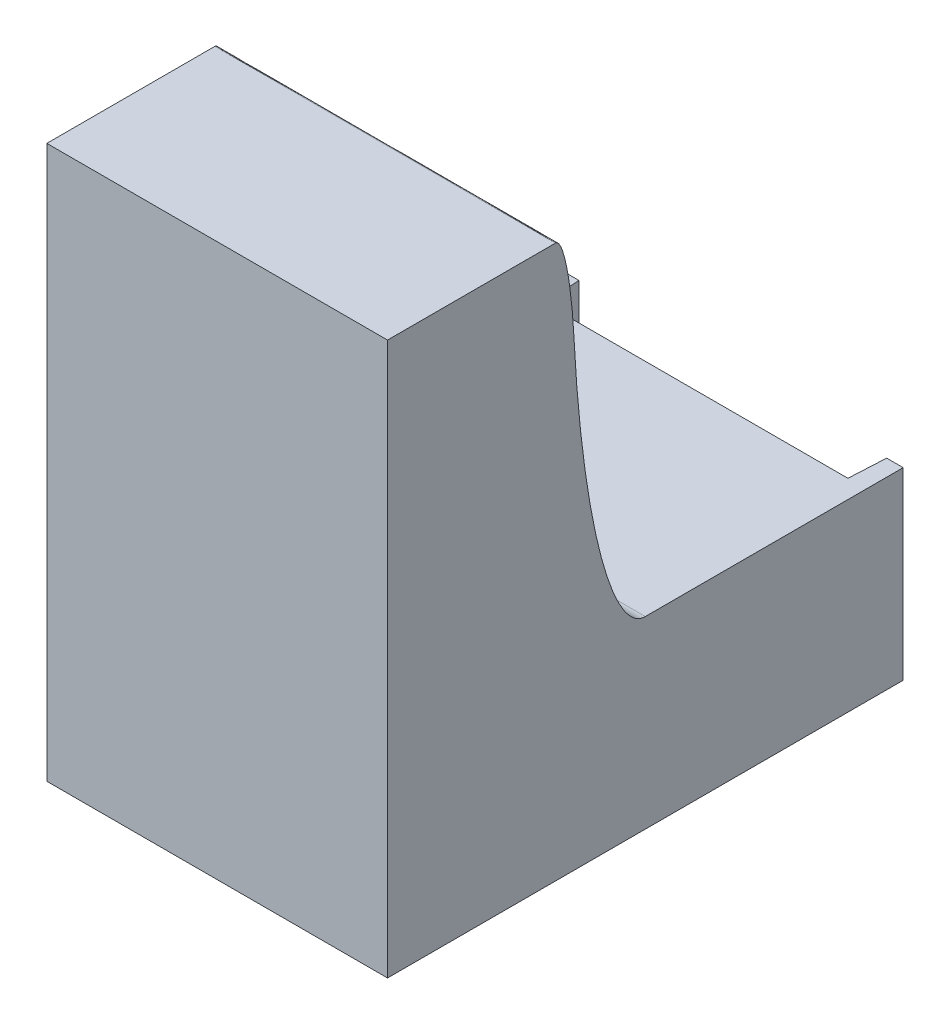
ISO-10303-21;
HEADER;
FILE_DESCRIPTION(('STEP AP214'),'2;1');
FILE_NAME('part.step','',(''),(''),'','','');
FILE_SCHEMA(('AUTOMOTIVE_DESIGN { 1 0 10303 214 1 1 1 1 }'));
ENDSEC;
DATA;
#1=APPLICATION_CONTEXT('core data for automotive mechanical design processes');
#2=APPLICATION_PROTOCOL_DEFINITION('international standard','automotive_design',2000,#1);
#3=PRODUCT_CONTEXT('',#1,'mechanical');
#4=PRODUCT('Part','Part','',(#3));
#5=PRODUCT_RELATED_PRODUCT_CATEGORY('part','',(#4));
#6=PRODUCT_DEFINITION_FORMATION('','',#4);
#7=PRODUCT_DEFINITION_CONTEXT('part definition',#1,'design');
#8=PRODUCT_DEFINITION('design','',#6,#7);
#9=PRODUCT_DEFINITION_SHAPE('','',#8);
#10=(LENGTH_UNIT() NAMED_UNIT(*) SI_UNIT(.MILLI.,.METRE.));
#11=(NAMED_UNIT(*) PLANE_ANGLE_UNIT() SI_UNIT($,.RADIAN.));
#12=(NAMED_UNIT(*) SI_UNIT($,.STERADIAN.) SOLID_ANGLE_UNIT());
#13=UNCERTAINTY_MEASURE_WITH_UNIT(LENGTH_MEASURE(1.E-05),#10,'distance_accuracy_value','');
#14=(GEOMETRIC_REPRESENTATION_CONTEXT(3) GLOBAL_UNCERTAINTY_ASSIGNED_CONTEXT((#13)) GLOBAL_UNIT_ASSIGNED_CONTEXT((#10,
#11,#12)) REPRESENTATION_CONTEXT('',''));
#15=CARTESIAN_POINT('',(0.,0.,0.));
#16=DIRECTION('',(0.,0.,1.));
#17=DIRECTION('',(1.,0.,0.));
#18=AXIS2_PLACEMENT_3D('',#15,#16,#17);
#19=CARTESIAN_POINT('',(0.,0.,26.));
#20=DIRECTION('',(0.,0.,1.));
#21=DIRECTION('',(1.,0.,0.));
#22=AXIS2_PLACEMENT_3D('',#19,#20,#21);
#23=PLANE('',#22);
#24=DIRECTION('',(-1.,0.,0.));
#25=VECTOR('',#24,1.);
#26=CARTESIAN_POINT('',(0.,1.,26.));
#27=LINE('',#26,#25);
#28=CARTESIAN_POINT('',(66.,1.,26.));
#29=VERTEX_POINT('',#28);
#30=CARTESIAN_POINT('',(49.5,1.,26.));
#31=VERTEX_POINT('',#30);
#32=EDGE_CURVE('E159',#29,#31,#27,.T.);
#33=ORIENTED_EDGE('',*,*,#32,.T.);
#34=DIRECTION('',(0.,1.,0.));
#35=VECTOR('',#34,1.);
#36=CARTESIAN_POINT('',(49.5,0.,26.));
#37=LINE('',#36,#35);
#38=CARTESIAN_POINT('',(49.5,10.,26.));
#39=VERTEX_POINT('',#38);
#40=EDGE_CURVE('E40',#31,#39,#37,.T.);
#41=ORIENTED_EDGE('',*,*,#40,.T.);
#42=DIRECTION('',(-1.,0.,0.));
#43=VECTOR('',#42,1.);
#44=CARTESIAN_POINT('',(48.5,10.,26.));
#45=LINE('',#44,#43);
#46=CARTESIAN_POINT('',(66.,10.,26.));
#47=VERTEX_POINT('',#46);
#48=EDGE_CURVE('E166',#47,#39,#45,.T.);
#49=ORIENTED_EDGE('',*,*,#48,.F.);
#50=DIRECTION('',(0.,-1.,0.));
#51=VECTOR('',#50,1.);
#52=CARTESIAN_POINT('',(66.,0.,26.));
#53=LINE('',#52,#51);
#54=EDGE_CURVE('E161',#47,#29,#53,.T.);
#55=ORIENTED_EDGE('',*,*,#54,.T.);
#56=EDGE_LOOP('',(#33,#41,#49,#55));
#57=FACE_BOUND('',#56,.T.);
#58=ADVANCED_FACE('F37',(#57),#23,.F.);
#59=CARTESIAN_POINT('',(48.5,10.,52.));
#60=DIRECTION('',(0.,-1.,0.));
#61=DIRECTION('',(0.,0.,-1.));
#62=AXIS2_PLACEMENT_3D('',#59,#60,#61);
#63=PLANE('',#62);
#64=DIRECTION('',(0.,0.,-1.));
#65=VECTOR('',#64,1.);
#66=CARTESIAN_POINT('',(67.,10.,52.));
#67=LINE('',#66,#65);
#68=CARTESIAN_POINT('',(67.,10.,38.));
#69=VERTEX_POINT('',#68);
#70=CARTESIAN_POINT('',(67.,10.,24.));
#71=VERTEX_POINT('',#70);
#72=EDGE_CURVE('E121',#69,#71,#67,.T.);
#73=ORIENTED_EDGE('',*,*,#72,.T.);
#74=DIRECTION('',(-1.,0.,0.));
#75=VECTOR('',#74,1.);
#76=CARTESIAN_POINT('',(48.5,10.,24.));
#77=LINE('',#76,#75);
#78=CARTESIAN_POINT('',(66.1048155585661,10.,24.));
#79=VERTEX_POINT('',#78);
#80=EDGE_CURVE('E124',#71,#79,#77,.T.);
#81=ORIENTED_EDGE('',*,*,#80,.T.);
#82=DIRECTION('',(-0.0523359562429438,0.,0.998629534754574));
#83=VECTOR('',#82,1.);
#84=CARTESIAN_POINT('',(66.05659504774,10.,24.9201021582237));
#85=LINE('',#84,#83);
#86=EDGE_CURVE('E169',#79,#47,#85,.T.);
#87=ORIENTED_EDGE('',*,*,#86,.T.);
#88=ORIENTED_EDGE('',*,*,#48,.T.);
#89=DIRECTION('',(0.0523359562429438,0.,0.998629534754574));
#90=VECTOR('',#89,1.);
#91=CARTESIAN_POINT('',(49.5,10.,26.));
#92=LINE('',#91,#90);
#93=CARTESIAN_POINT('',(49.3951844414339,10.,24.));
#94=VERTEX_POINT('',#93);
#95=EDGE_CURVE('E173',#94,#39,#92,.T.);
#96=ORIENTED_EDGE('',*,*,#95,.F.);
#97=CARTESIAN_POINT('',(48.5,10.,24.));
#98=VERTEX_POINT('',#97);
#99=EDGE_CURVE('E147',#94,#98,#77,.T.);
#100=ORIENTED_EDGE('',*,*,#99,.T.);
#101=DIRECTION('',(0.,0.,-1.));
#102=VECTOR('',#101,1.);
#103=CARTESIAN_POINT('',(48.5,10.,52.));
#104=LINE('',#103,#102);
#105=CARTESIAN_POINT('',(48.5,10.,38.));
#106=VERTEX_POINT('',#105);
#107=EDGE_CURVE('E133',#106,#98,#104,.T.);
#108=ORIENTED_EDGE('',*,*,#107,.F.);
#109=CARTESIAN_POINT('',(67.925,10.,38.));
#110=CARTESIAN_POINT('',(61.1416666666666,10.,38.));
#111=CARTESIAN_POINT('',(54.3583333333333,10.,38.));
#112=CARTESIAN_POINT('',(47.575,10.,38.));
#113=(BOUNDED_CURVE() B_SPLINE_CURVE(3,(#109,#110,#111,#112),.UNSPECIFIED.,.F.,
.F.) B_SPLINE_CURVE_WITH_KNOTS((4,4),(-0.000924999999999999,0.019425),
.UNSPECIFIED.) CURVE() GEOMETRIC_REPRESENTATION_ITEM() RATIONAL_B_SPLINE_CURVE((1.,1.,1.,1.)) REPRESENTATION_ITEM(''));
#114=EDGE_CURVE('E127',#106,#69,#113,.F.);
#115=ORIENTED_EDGE('',*,*,#114,.T.);
#116=EDGE_LOOP('',(#73,#81,#87,#88,#96,#100,#108,#115));
#117=FACE_BOUND('',#116,.T.);
#118=ADVANCED_FACE('F123',(#117),#63,.F.);
#119=CARTESIAN_POINT('',(0.,0.,10.));
#120=DIRECTION('',(0.,1.,0.));
#121=DIRECTION('',(0.,0.,1.));
#122=AXIS2_PLACEMENT_3D('',#119,#120,#121);
#123=PLANE('',#122);
#124=DIRECTION('',(0.,0.,-1.));
#125=VECTOR('',#124,1.);
#126=CARTESIAN_POINT('',(48.5,0.,52.));
#127=LINE('',#126,#125);
#128=CARTESIAN_POINT('',(48.5,0.,52.));
#129=VERTEX_POINT('',#128);
#130=CARTESIAN_POINT('',(48.5,0.,24.));
#131=VERTEX_POINT('',#130);
#132=EDGE_CURVE('E226',#129,#131,#127,.T.);
#133=ORIENTED_EDGE('',*,*,#132,.T.);
#134=DIRECTION('',(1.,0.,0.));
#135=VECTOR('',#134,1.);
#136=CARTESIAN_POINT('',(0.,0.,24.));
#137=LINE('',#136,#135);
#138=CARTESIAN_POINT('',(67.,0.,24.));
#139=VERTEX_POINT('',#138);
#140=EDGE_CURVE('E152',#131,#139,#137,.T.);
#141=ORIENTED_EDGE('',*,*,#140,.T.);
#142=DIRECTION('',(0.,0.,-1.));
#143=VECTOR('',#142,1.);
#144=CARTESIAN_POINT('',(67.,0.,52.));
#145=LINE('',#144,#143);
#146=CARTESIAN_POINT('',(67.,0.,52.));
#147=VERTEX_POINT('',#146);
#148=EDGE_CURVE('E134',#147,#139,#145,.T.);
#149=ORIENTED_EDGE('',*,*,#148,.F.);
#150=DIRECTION('',(1.,0.,0.));
#151=VECTOR('',#150,1.);
#152=CARTESIAN_POINT('',(48.5,0.,52.));
#153=LINE('',#152,#151);
#154=EDGE_CURVE('E498',#129,#147,#153,.T.);
#155=ORIENTED_EDGE('',*,*,#154,.F.);
#156=EDGE_LOOP('',(#133,#141,#149,#155));
#157=FACE_BOUND('',#156,.T.);
#158=ADVANCED_FACE('F291',(#157),#123,.F.);
#159=CARTESIAN_POINT('',(48.5,0.,52.));
#160=DIRECTION('',(1.,0.,0.));
#161=DIRECTION('',(0.,0.,-1.));
#162=AXIS2_PLACEMENT_3D('',#159,#160,#161);
#163=PLANE('',#162);
#164=ORIENTED_EDGE('',*,*,#107,.T.);
#165=DIRECTION('',(0.,-1.,0.));
#166=VECTOR('',#165,1.);
#167=CARTESIAN_POINT('',(48.5,0.,24.));
#168=LINE('',#167,#166);
#169=EDGE_CURVE('E154',#98,#131,#168,.T.);
#170=ORIENTED_EDGE('',*,*,#169,.T.);
#171=ORIENTED_EDGE('',*,*,#132,.F.);
#172=DIRECTION('',(0.,-1.,0.));
#173=VECTOR('',#172,1.);
#174=CARTESIAN_POINT('',(48.5,0.,52.));
#175=LINE('',#174,#173);
#176=CARTESIAN_POINT('',(48.5,30.,52.));
#177=VERTEX_POINT('',#176);
#178=EDGE_CURVE('E496',#177,#129,#175,.T.);
#179=ORIENTED_EDGE('',*,*,#178,.F.);
#180=DIRECTION('',(0.,0.,1.));
#181=VECTOR('',#180,1.);
#182=CARTESIAN_POINT('',(48.5,30.,52.));
#183=LINE('',#182,#181);
#184=CARTESIAN_POINT('',(48.5,30.,42.8743013109692));
#185=VERTEX_POINT('',#184);
#186=EDGE_CURVE('E12',#185,#177,#183,.T.);
#187=ORIENTED_EDGE('',*,*,#186,.F.);
#188=CARTESIAN_POINT('',(48.5,25.0510118754307,41.8756032642306));
#189=CARTESIAN_POINT('',(48.5,29.9999999999986,42.1283895458696));
#190=CARTESIAN_POINT('',(48.5,30.,42.8743013109692));
#191=(BOUNDED_CURVE() B_SPLINE_CURVE(2,(#188,#189,#190),.UNSPECIFIED.,.F.,
.F.) B_SPLINE_CURVE_WITH_KNOTS((3,3),(0.,1.),
.UNSPECIFIED.) CURVE() GEOMETRIC_REPRESENTATION_ITEM() RATIONAL_B_SPLINE_CURVE((1.,
0.72491788342915,1.)) REPRESENTATION_ITEM(''));
#192=CARTESIAN_POINT('',(48.5,25.0510116808237,41.8756070670597));
#193=VERTEX_POINT('',#192);
#194=EDGE_CURVE('E485',#185,#193,#191,.F.);
#195=ORIENTED_EDGE('',*,*,#194,.T.);
#196=CARTESIAN_POINT('',(48.5,10.,38.));
#197=CARTESIAN_POINT('',(48.5,10.,42.));
#198=CARTESIAN_POINT('',(48.5,30.,42.));
#199=(BOUNDED_CURVE() B_SPLINE_CURVE(2,(#196,#197,#198),.UNSPECIFIED.,.F.,
.F.) B_SPLINE_CURVE_WITH_KNOTS((3,3),(0.,1.),
.UNSPECIFIED.) CURVE() GEOMETRIC_REPRESENTATION_ITEM() RATIONAL_B_SPLINE_CURVE((1.,
0.707106781186548,1.)) REPRESENTATION_ITEM(''));
#200=EDGE_CURVE('E221',#193,#106,#199,.F.);
#201=ORIENTED_EDGE('',*,*,#200,.T.);
#202=EDGE_LOOP('',(#164,#170,#171,#179,#187,#195,#201));
#203=FACE_BOUND('',#202,.T.);
#204=ADVANCED_FACE('F281',(#203),#163,.F.);
#205=CARTESIAN_POINT('',(67.,0.,52.));
#206=DIRECTION('',(-1.,0.,0.));
#207=DIRECTION('',(0.,0.,1.));
#208=AXIS2_PLACEMENT_3D('',#205,#206,#207);
#209=PLANE('',#208);
#210=ORIENTED_EDGE('',*,*,#148,.T.);
#211=DIRECTION('',(0.,1.,0.));
#212=VECTOR('',#211,1.);
#213=CARTESIAN_POINT('',(67.,0.,24.));
#214=LINE('',#213,#212);
#215=EDGE_CURVE('E142',#139,#71,#214,.T.);
#216=ORIENTED_EDGE('',*,*,#215,.T.);
#217=ORIENTED_EDGE('',*,*,#72,.F.);
#218=CARTESIAN_POINT('',(67.,30.,42.));
#219=CARTESIAN_POINT('',(67.,10.,42.));
#220=CARTESIAN_POINT('',(67.,10.,38.));
#221=(BOUNDED_CURVE() B_SPLINE_CURVE(2,(#218,#219,#220),.UNSPECIFIED.,.F.,
.F.) B_SPLINE_CURVE_WITH_KNOTS((3,3),(0.,1.),
.UNSPECIFIED.) CURVE() GEOMETRIC_REPRESENTATION_ITEM() RATIONAL_B_SPLINE_CURVE((1.,
0.707106781186548,1.)) REPRESENTATION_ITEM(''));
#222=CARTESIAN_POINT('',(67.,25.0510116842867,41.8756069960222));
#223=VERTEX_POINT('',#222);
#224=EDGE_CURVE('E224',#69,#223,#221,.F.);
#225=ORIENTED_EDGE('',*,*,#224,.T.);
#226=CARTESIAN_POINT('',(67.,30.,42.8743013109748));
#227=CARTESIAN_POINT('',(67.,30.0000000000014,42.1283895458668));
#228=CARTESIAN_POINT('',(67.,25.0510118754324,41.8756032642307));
#229=(BOUNDED_CURVE() B_SPLINE_CURVE(2,(#226,#227,#228),.UNSPECIFIED.,.F.,
.F.) B_SPLINE_CURVE_WITH_KNOTS((3,3),(0.,1.),
.UNSPECIFIED.) CURVE() GEOMETRIC_REPRESENTATION_ITEM() RATIONAL_B_SPLINE_CURVE((1.,
0.72491788342915,1.)) REPRESENTATION_ITEM(''));
#230=CARTESIAN_POINT('',(67.,30.,42.8743013109748));
#231=VERTEX_POINT('',#230);
#232=EDGE_CURVE('E192',#223,#231,#229,.F.);
#233=ORIENTED_EDGE('',*,*,#232,.T.);
#234=DIRECTION('',(0.,0.,-1.));
#235=VECTOR('',#234,1.);
#236=CARTESIAN_POINT('',(67.,30.,52.));
#237=LINE('',#236,#235);
#238=CARTESIAN_POINT('',(67.,30.,52.));
#239=VERTEX_POINT('',#238);
#240=EDGE_CURVE('E493',#239,#231,#237,.T.);
#241=ORIENTED_EDGE('',*,*,#240,.F.);
#242=DIRECTION('',(0.,1.,0.));
#243=VECTOR('',#242,1.);
#244=CARTESIAN_POINT('',(67.,0.,52.));
#245=LINE('',#244,#243);
#246=EDGE_CURVE('E215',#147,#239,#245,.T.);
#247=ORIENTED_EDGE('',*,*,#246,.F.);
#248=EDGE_LOOP('',(#210,#216,#217,#225,#233,#241,#247));
#249=FACE_BOUND('',#248,.T.);
#250=ADVANCED_FACE('F149',(#249),#209,.F.);
#251=CARTESIAN_POINT('',(0.,0.,52.));
#252=DIRECTION('',(0.,0.,-1.));
#253=DIRECTION('',(-1.,0.,0.));
#254=AXIS2_PLACEMENT_3D('',#251,#252,#253);
#255=PLANE('',#254);
#256=ORIENTED_EDGE('',*,*,#178,.T.);
#257=ORIENTED_EDGE('',*,*,#154,.T.);
#258=ORIENTED_EDGE('',*,*,#246,.T.);
#259=DIRECTION('',(1.,0.,0.));
#260=VECTOR('',#259,1.);
#261=CARTESIAN_POINT('',(48.5,30.,52.));
#262=LINE('',#261,#260);
#263=EDGE_CURVE('E46',#177,#239,#262,.T.);
#264=ORIENTED_EDGE('',*,*,#263,.F.);
#265=EDGE_LOOP('',(#256,#257,#258,#264));
#266=FACE_BOUND('',#265,.T.);
#267=ADVANCED_FACE('F323',(#266),#255,.F.);
#268=CARTESIAN_POINT('',(0.,30.,0.));
#269=DIRECTION('',(0.,-1.,0.));
#270=DIRECTION('',(0.,0.,-1.));
#271=AXIS2_PLACEMENT_3D('',#268,#269,#270);
#272=PLANE('',#271);
#273=ORIENTED_EDGE('',*,*,#240,.T.);
#274=CARTESIAN_POINT('',(47.575,30.,42.874301310972));
#275=CARTESIAN_POINT('',(54.3583333333333,30.,42.8743013109485));
#276=CARTESIAN_POINT('',(61.1416666666667,30.,42.8743013109955));
#277=CARTESIAN_POINT('',(67.925,30.,42.874301310972));
#278=(BOUNDED_CURVE() B_SPLINE_CURVE(3,(#274,#275,#276,#277),.UNSPECIFIED.,.F.,
.F.) B_SPLINE_CURVE_WITH_KNOTS((4,4),(-0.010175,0.010175),
.UNSPECIFIED.) CURVE() GEOMETRIC_REPRESENTATION_ITEM() RATIONAL_B_SPLINE_CURVE((1.,1.,1.,1.)) REPRESENTATION_ITEM(''));
#279=EDGE_CURVE('E461',#231,#185,#278,.F.);
#280=ORIENTED_EDGE('',*,*,#279,.T.);
#281=ORIENTED_EDGE('',*,*,#186,.T.);
#282=ORIENTED_EDGE('',*,*,#263,.T.);
#283=EDGE_LOOP('',(#273,#280,#281,#282));
#284=FACE_BOUND('',#283,.T.);
#285=ADVANCED_FACE('F248',(#284),#272,.F.);
#286=CARTESIAN_POINT('',(47.575,10.,38.));
#287=CARTESIAN_POINT('',(54.3583333333333,10.,38.));
#288=CARTESIAN_POINT('',(61.1416666666666,10.,38.));
#289=CARTESIAN_POINT('',(67.925,10.,38.));
#290=CARTESIAN_POINT('',(47.575,10.,42.));
#291=CARTESIAN_POINT('',(54.3583333333333,10.,42.));
#292=CARTESIAN_POINT('',(61.1416666666667,10.,42.));
#293=CARTESIAN_POINT('',(67.925,10.,42.));
#294=CARTESIAN_POINT('',(47.575,30.,42.));
#295=CARTESIAN_POINT('',(54.3583333333333,30.,42.));
#296=CARTESIAN_POINT('',(61.1416666666666,30.,42.));
#297=CARTESIAN_POINT('',(67.925,30.,42.));
#298=(BOUNDED_SURFACE() B_SPLINE_SURFACE(2,3,((#286,#287,#288,#289),(#290,#291,#292,#293),(#294,
#295,#296,#297)),.UNSPECIFIED.,.F.,.F.,.F.) B_SPLINE_SURFACE_WITH_KNOTS((3,3),(4,4),(0.,1.),
(-0.000924999999999999,0.019425),
.UNSPECIFIED.) GEOMETRIC_REPRESENTATION_ITEM() RATIONAL_B_SPLINE_SURFACE(((1.,1.,1.,1.),
(0.707106781186548,0.707106781186548,0.707106781186548,0.707106781186548),(1.,1.,1.,1.))) REPRESENTATION_ITEM('') SURFACE());
#299=CARTESIAN_POINT('',(47.575,25.0510118754307,41.8756032642306));
#300=CARTESIAN_POINT('',(54.3583333333333,25.0510118754307,41.8756032642306));
#301=CARTESIAN_POINT('',(61.1416666666667,25.0510118754307,41.8756032642306));
#302=CARTESIAN_POINT('',(67.925,25.0510118754307,41.8756032642306));
#303=(BOUNDED_CURVE() B_SPLINE_CURVE(3,(#299,#300,#301,#302),.UNSPECIFIED.,.F.,
.F.) B_SPLINE_CURVE_WITH_KNOTS((4,4),(-0.000924999999999999,0.019425),
.UNSPECIFIED.) CURVE() GEOMETRIC_REPRESENTATION_ITEM() RATIONAL_B_SPLINE_CURVE((0.917755188622373,
0.917755188622373,0.917755188622373,0.917755188622373)) REPRESENTATION_ITEM(''));
#304=EDGE_CURVE('E276',#193,#223,#303,.T.);
#305=ORIENTED_EDGE('',*,*,#200,.F.);
#306=ORIENTED_EDGE('',*,*,#304,.T.);
#307=ORIENTED_EDGE('',*,*,#224,.F.);
#308=ORIENTED_EDGE('',*,*,#114,.F.);
#309=EDGE_LOOP('',(#305,#306,#307,#308));
#310=FACE_BOUND('',#309,.T.);
#311=ADVANCED_FACE('F220',(#310),#298,.T.);
#312=CARTESIAN_POINT('',(47.575,25.0510118754308,41.8756032642306));
#313=CARTESIAN_POINT('',(54.3583333333335,25.0510118754296,41.8756032642305));
#314=CARTESIAN_POINT('',(61.1416666666666,25.0510118754437,41.8756032642313));
#315=CARTESIAN_POINT('',(67.925,25.0510118754308,41.8756032642306));
#316=CARTESIAN_POINT('',(47.575,30.,42.1283895458727));
#317=CARTESIAN_POINT('',(54.3583333333334,29.9999999999882,42.1283895458492));
#318=CARTESIAN_POINT('',(61.1416666666667,30.0000000000118,42.1283895458257));
#319=CARTESIAN_POINT('',(67.925,30.,42.1283895458727));
#320=CARTESIAN_POINT('',(47.575,30.,42.874301310972));
#321=CARTESIAN_POINT('',(54.3583333333333,30.,42.8743013109485));
#322=CARTESIAN_POINT('',(61.1416666666667,30.,42.8743013109955));
#323=CARTESIAN_POINT('',(67.925,30.,42.874301310972));
#324=(BOUNDED_SURFACE() B_SPLINE_SURFACE(2,3,((#312,#313,#314,#315),(#316,#317,#318,#319),(#320,
#321,#322,#323)),.UNSPECIFIED.,.F.,.F.,.F.) B_SPLINE_SURFACE_WITH_KNOTS((3,3),(4,4),(0.,1.),
(-0.010175,0.010175),
.UNSPECIFIED.) GEOMETRIC_REPRESENTATION_ITEM() RATIONAL_B_SPLINE_SURFACE(((1.,1.,1.,1.),
(0.72491788342915,0.72491788342915,0.72491788342915,0.72491788342915),(1.,1.,1.,1.))) REPRESENTATION_ITEM('') SURFACE());
#325=ORIENTED_EDGE('',*,*,#232,.F.);
#326=ORIENTED_EDGE('',*,*,#304,.F.);
#327=ORIENTED_EDGE('',*,*,#194,.F.);
#328=ORIENTED_EDGE('',*,*,#279,.F.);
#329=EDGE_LOOP('',(#325,#326,#327,#328));
#330=FACE_BOUND('',#329,.T.);
#331=ADVANCED_FACE('F247',(#330),#324,.T.);
#332=CARTESIAN_POINT('',(49.5,0.,26.));
#333=DIRECTION('',(0.998629534754574,0.,-0.0523359562429438));
#334=DIRECTION('',(-0.0523359562429438,0.,-0.998629534754574));
#335=AXIS2_PLACEMENT_3D('',#332,#333,#334);
#336=PLANE('',#335);
#337=ORIENTED_EDGE('',*,*,#40,.F.);
#338=DIRECTION('',(0.0522644276887139,0.0522644276887139,0.997264688634237));
#339=VECTOR('',#338,1.);
#340=CARTESIAN_POINT('',(49.4972684295984,0.997268429598371,25.9478785317944));
#341=LINE('',#340,#339);
#342=CARTESIAN_POINT('',(49.3951844414339,0.895184441433918,24.));
#343=VERTEX_POINT('',#342);
#344=EDGE_CURVE('E164',#343,#31,#341,.T.);
#345=ORIENTED_EDGE('',*,*,#344,.F.);
#346=DIRECTION('',(0.,1.,0.));
#347=VECTOR('',#346,1.);
#348=CARTESIAN_POINT('',(49.3951844414339,0.,24.));
#349=LINE('',#348,#347);
#350=EDGE_CURVE('E170',#343,#94,#349,.T.);
#351=ORIENTED_EDGE('',*,*,#350,.T.);
#352=ORIENTED_EDGE('',*,*,#95,.T.);
#353=EDGE_LOOP('',(#337,#345,#351,#352));
#354=FACE_BOUND('',#353,.T.);
#355=ADVANCED_FACE('F202',(#354),#336,.T.);
#356=CARTESIAN_POINT('',(0.,1.,26.));
#357=DIRECTION('',(0.,0.998629534754574,-0.0523359562429438));
#358=DIRECTION('',(0.,0.0523359562429438,0.998629534754574));
#359=AXIS2_PLACEMENT_3D('',#356,#357,#358);
#360=PLANE('',#359);
#361=ORIENTED_EDGE('',*,*,#32,.F.);
#362=DIRECTION('',(-0.0522644276887139,0.0522644276887139,0.997264688634237));
#363=VECTOR('',#362,1.);
#364=CARTESIAN_POINT('',(65.8197163534925,1.1802836465075,29.4400169015717));
#365=LINE('',#364,#363);
#366=CARTESIAN_POINT('',(66.1048155585661,0.895184441433918,24.));
#367=VERTEX_POINT('',#366);
#368=EDGE_CURVE('E167',#367,#29,#365,.T.);
#369=ORIENTED_EDGE('',*,*,#368,.F.);
#370=DIRECTION('',(-1.,0.,0.));
#371=VECTOR('',#370,1.);
#372=CARTESIAN_POINT('',(0.,0.895184441433918,24.));
#373=LINE('',#372,#371);
#374=EDGE_CURVE('E174',#367,#343,#373,.T.);
#375=ORIENTED_EDGE('',*,*,#374,.T.);
#376=ORIENTED_EDGE('',*,*,#344,.T.);
#377=EDGE_LOOP('',(#361,#369,#375,#376));
#378=FACE_BOUND('',#377,.T.);
#379=ADVANCED_FACE('F212',(#378),#360,.T.);
#380=CARTESIAN_POINT('',(66.,0.,26.));
#381=DIRECTION('',(-0.998629534754574,0.,-0.0523359562429438));
#382=DIRECTION('',(-0.0523359562429438,0.,0.998629534754574));
#383=AXIS2_PLACEMENT_3D('',#380,#381,#382);
#384=PLANE('',#383);
#385=ORIENTED_EDGE('',*,*,#54,.F.);
#386=ORIENTED_EDGE('',*,*,#86,.F.);
#387=DIRECTION('',(0.,-1.,0.));
#388=VECTOR('',#387,1.);
#389=CARTESIAN_POINT('',(66.1048155585661,0.,24.));
#390=LINE('',#389,#388);
#391=EDGE_CURVE('E146',#79,#367,#390,.T.);
#392=ORIENTED_EDGE('',*,*,#391,.T.);
#393=ORIENTED_EDGE('',*,*,#368,.T.);
#394=EDGE_LOOP('',(#385,#386,#392,#393));
#395=FACE_BOUND('',#394,.T.);
#396=ADVANCED_FACE('F210',(#395),#384,.T.);
#397=CARTESIAN_POINT('',(0.,0.,24.));
#398=DIRECTION('',(0.,0.,1.));
#399=DIRECTION('',(1.,0.,0.));
#400=AXIS2_PLACEMENT_3D('',#397,#398,#399);
#401=PLANE('',#400);
#402=ORIENTED_EDGE('',*,*,#350,.F.);
#403=ORIENTED_EDGE('',*,*,#374,.F.);
#404=ORIENTED_EDGE('',*,*,#391,.F.);
#405=ORIENTED_EDGE('',*,*,#80,.F.);
#406=ORIENTED_EDGE('',*,*,#215,.F.);
#407=ORIENTED_EDGE('',*,*,#140,.F.);
#408=ORIENTED_EDGE('',*,*,#169,.F.);
#409=ORIENTED_EDGE('',*,*,#99,.F.);
#410=EDGE_LOOP('',(#402,#403,#404,#405,#406,#407,#408,#409));
#411=FACE_BOUND('',#410,.T.);
#412=ADVANCED_FACE('F140',(#411),#401,.F.);
#413=CLOSED_SHELL('',(#58,#118,#158,#204,#250,#267,#285,#311,#331,#355,#379,#396,#412));
#414=MANIFOLD_SOLID_BREP('B2',#413);
#415=ADVANCED_BREP_SHAPE_REPRESENTATION('',(#18,#414),#14);
#416=SHAPE_DEFINITION_REPRESENTATION(#9,#415);
ENDSEC;
END-ISO-10303-21;
